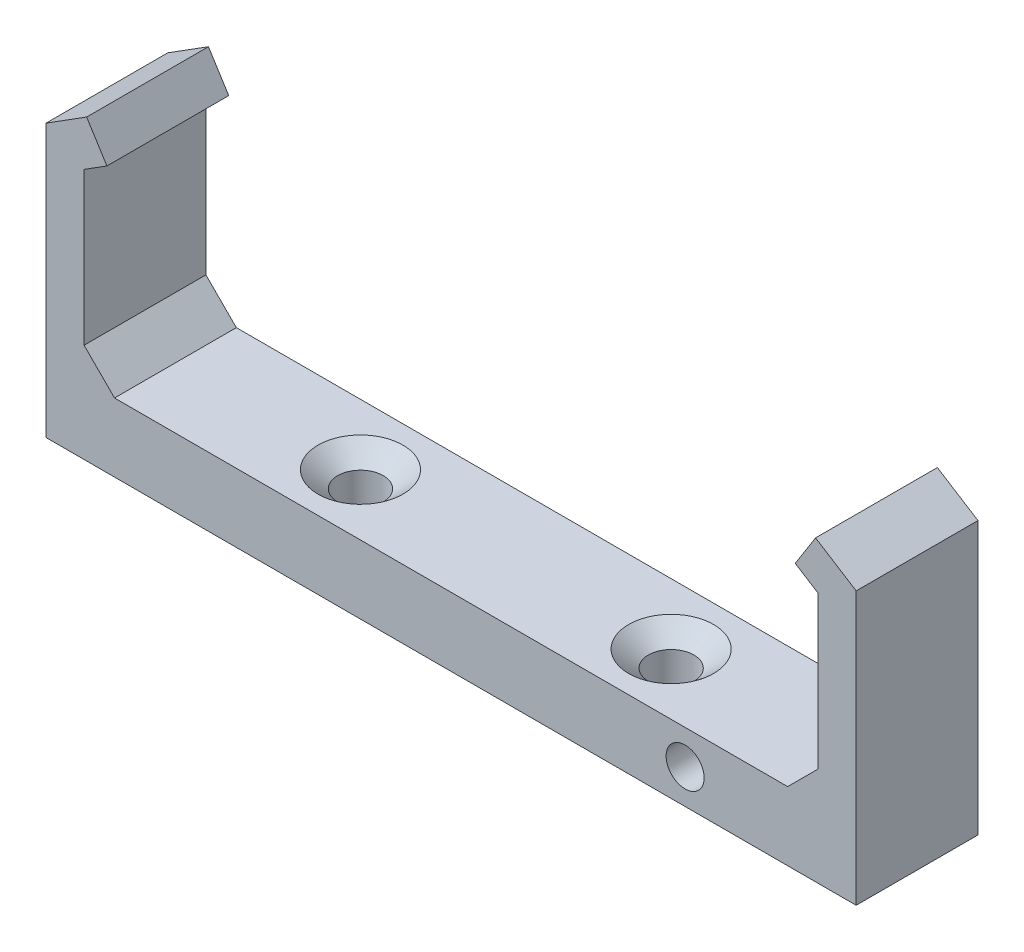
ISO-10303-21;
HEADER;
FILE_DESCRIPTION(('STEP AP214'),'2;1');
FILE_NAME('part.step','',(''),(''),'','','');
FILE_SCHEMA(('AUTOMOTIVE_DESIGN { 1 0 10303 214 1 1 1 1 }'));
ENDSEC;
DATA;
#1=APPLICATION_CONTEXT('core data for automotive mechanical design processes');
#2=APPLICATION_PROTOCOL_DEFINITION('international standard','automotive_design',2000,#1);
#3=PRODUCT_CONTEXT('',#1,'mechanical');
#4=PRODUCT('Part','Part','',(#3));
#5=PRODUCT_RELATED_PRODUCT_CATEGORY('part','',(#4));
#6=PRODUCT_DEFINITION_FORMATION('','',#4);
#7=PRODUCT_DEFINITION_CONTEXT('part definition',#1,'design');
#8=PRODUCT_DEFINITION('design','',#6,#7);
#9=PRODUCT_DEFINITION_SHAPE('','',#8);
#10=(LENGTH_UNIT() NAMED_UNIT(*) SI_UNIT(.MILLI.,.METRE.));
#11=(NAMED_UNIT(*) PLANE_ANGLE_UNIT() SI_UNIT($,.RADIAN.));
#12=(NAMED_UNIT(*) SI_UNIT($,.STERADIAN.) SOLID_ANGLE_UNIT());
#13=UNCERTAINTY_MEASURE_WITH_UNIT(LENGTH_MEASURE(1.E-05),#10,'distance_accuracy_value','');
#14=(GEOMETRIC_REPRESENTATION_CONTEXT(3) GLOBAL_UNCERTAINTY_ASSIGNED_CONTEXT((#13)) GLOBAL_UNIT_ASSIGNED_CONTEXT((#10,
#11,#12)) REPRESENTATION_CONTEXT('',''));
#15=CARTESIAN_POINT('',(0.,0.,0.));
#16=DIRECTION('',(0.,0.,1.));
#17=DIRECTION('',(1.,0.,0.));
#18=AXIS2_PLACEMENT_3D('',#15,#16,#17);
#19=CARTESIAN_POINT('',(0.,0.0704574444268354,-5.08));
#20=DIRECTION('',(0.,-1.,0.));
#21=DIRECTION('',(1.,0.,0.));
#22=AXIS2_PLACEMENT_3D('',#19,#20,#21);
#23=PLANE('',#22);
#24=CARTESIAN_POINT('',(-12.954,0.070457444426839,0.));
#25=DIRECTION('',(0.,1.,0.));
#26=DIRECTION('',(0.,0.,1.));
#27=AXIS2_PLACEMENT_3D('',#24,#25,#26);
#28=CIRCLE('',#27,3.5433);
#29=CARTESIAN_POINT('',(-12.954,0.070457444426839,3.5433));
#30=VERTEX_POINT('',#29);
#31=EDGE_CURVE('E171',#30,#30,#28,.T.);
#32=ORIENTED_EDGE('',*,*,#31,.F.);
#33=EDGE_LOOP('',(#32));
#34=FACE_BOUND('',#33,.T.);
#35=CARTESIAN_POINT('',(12.954,0.0704574444268355,0.));
#36=DIRECTION('',(0.,1.,0.));
#37=DIRECTION('',(0.,0.,1.));
#38=AXIS2_PLACEMENT_3D('',#35,#36,#37);
#39=CIRCLE('',#38,3.5433);
#40=CARTESIAN_POINT('',(12.954,0.0704574444268355,3.5433));
#41=VERTEX_POINT('',#40);
#42=EDGE_CURVE('E177',#41,#41,#39,.T.);
#43=ORIENTED_EDGE('',*,*,#42,.F.);
#44=EDGE_LOOP('',(#43));
#45=FACE_BOUND('',#44,.T.);
#46=DIRECTION('',(1.,0.,0.));
#47=VECTOR('',#46,1.);
#48=CARTESIAN_POINT('',(0.,0.0704574444268354,-5.08));
#49=LINE('',#48,#47);
#50=CARTESIAN_POINT('',(-28.3845,0.0704574444268389,-5.08));
#51=VERTEX_POINT('',#50);
#52=CARTESIAN_POINT('',(27.7495,0.0704574444268319,-5.08));
#53=VERTEX_POINT('',#52);
#54=EDGE_CURVE('E230',#51,#53,#49,.T.);
#55=ORIENTED_EDGE('',*,*,#54,.F.);
#56=DIRECTION('',(0.,0.,1.));
#57=VECTOR('',#56,1.);
#58=CARTESIAN_POINT('',(-28.3845,0.0704574444268389,-5.08));
#59=LINE('',#58,#57);
#60=CARTESIAN_POINT('',(-28.3845,0.0704574444268389,5.08));
#61=VERTEX_POINT('',#60);
#62=EDGE_CURVE('E261',#51,#61,#59,.T.);
#63=ORIENTED_EDGE('',*,*,#62,.T.);
#64=DIRECTION('',(1.,0.,0.));
#65=VECTOR('',#64,1.);
#66=CARTESIAN_POINT('',(0.,0.0704574444268354,5.08));
#67=LINE('',#66,#65);
#68=CARTESIAN_POINT('',(27.7495,0.0704574444268319,5.08));
#69=VERTEX_POINT('',#68);
#70=EDGE_CURVE('E209',#61,#69,#67,.T.);
#71=ORIENTED_EDGE('',*,*,#70,.T.);
#72=DIRECTION('',(0.,0.,-1.));
#73=VECTOR('',#72,1.);
#74=CARTESIAN_POINT('',(27.7495,0.0704574444268319,-5.08));
#75=LINE('',#74,#73);
#76=EDGE_CURVE('E253',#69,#53,#75,.T.);
#77=ORIENTED_EDGE('',*,*,#76,.T.);
#78=EDGE_LOOP('',(#55,#63,#71,#77));
#79=FACE_BOUND('',#78,.T.);
#80=ADVANCED_FACE('F35',(#34,#45,#79),#23,.F.);
#81=CARTESIAN_POINT('',(-15.6836698362084,24.9073206274878,-5.08));
#82=DIRECTION('',(-0.53284447853788,0.846213189268339,0.));
#83=DIRECTION('',(-0.84621318926834,-0.53284447853788,0.));
#84=AXIS2_PLACEMENT_3D('',#81,#82,#83);
#85=PLANE('',#84);
#86=DIRECTION('',(0.,0.,1.));
#87=VECTOR('',#86,1.);
#88=CARTESIAN_POINT('',(-29.0195,16.51,-5.08));
#89=LINE('',#88,#87);
#90=CARTESIAN_POINT('',(-29.0195,16.51,-5.08));
#91=VERTEX_POINT('',#90);
#92=CARTESIAN_POINT('',(-29.0195,16.51,5.08));
#93=VERTEX_POINT('',#92);
#94=EDGE_CURVE('E234',#91,#93,#89,.T.);
#95=ORIENTED_EDGE('',*,*,#94,.T.);
#96=DIRECTION('',(-0.84621318926834,-0.53284447853788,0.));
#97=VECTOR('',#96,1.);
#98=CARTESIAN_POINT('',(-15.6836698362084,24.9073206274878,5.08));
#99=LINE('',#98,#97);
#100=CARTESIAN_POINT('',(-30.9245,15.3104574444268,5.08));
#101=VERTEX_POINT('',#100);
#102=EDGE_CURVE('E183',#93,#101,#99,.T.);
#103=ORIENTED_EDGE('',*,*,#102,.T.);
#104=DIRECTION('',(0.,0.,1.));
#105=VECTOR('',#104,1.);
#106=CARTESIAN_POINT('',(-30.9245,15.3104574444268,-5.08));
#107=LINE('',#106,#105);
#108=CARTESIAN_POINT('',(-30.9245,15.3104574444268,-5.08));
#109=VERTEX_POINT('',#108);
#110=EDGE_CURVE('E235',#109,#101,#107,.T.);
#111=ORIENTED_EDGE('',*,*,#110,.F.);
#112=DIRECTION('',(-0.84621318926834,-0.53284447853788,0.));
#113=VECTOR('',#112,1.);
#114=CARTESIAN_POINT('',(-15.6836698362084,24.9073206274878,-5.08));
#115=LINE('',#114,#113);
#116=EDGE_CURVE('E213',#91,#109,#115,.T.);
#117=ORIENTED_EDGE('',*,*,#116,.F.);
#118=EDGE_LOOP('',(#95,#103,#111,#117));
#119=FACE_BOUND('',#118,.T.);
#120=ADVANCED_FACE('F306',(#119),#85,.F.);
#121=CARTESIAN_POINT('',(-30.9245,0.,-5.08));
#122=DIRECTION('',(1.,0.,0.));
#123=DIRECTION('',(0.,0.,-1.));
#124=AXIS2_PLACEMENT_3D('',#121,#122,#123);
#125=PLANE('',#124);
#126=DIRECTION('',(0.,1.,0.));
#127=VECTOR('',#126,1.);
#128=CARTESIAN_POINT('',(-30.9245,0.,5.08));
#129=LINE('',#128,#127);
#130=CARTESIAN_POINT('',(-30.9245,2.61045744442683,5.08));
#131=VERTEX_POINT('',#130);
#132=EDGE_CURVE('E211',#131,#101,#129,.T.);
#133=ORIENTED_EDGE('',*,*,#132,.F.);
#134=DIRECTION('',(0.,0.,-1.));
#135=VECTOR('',#134,1.);
#136=CARTESIAN_POINT('',(-30.9245,2.61045744442683,-5.08));
#137=LINE('',#136,#135);
#138=CARTESIAN_POINT('',(-30.9245,2.61045744442683,-5.08));
#139=VERTEX_POINT('',#138);
#140=EDGE_CURVE('E50',#131,#139,#137,.T.);
#141=ORIENTED_EDGE('',*,*,#140,.T.);
#142=DIRECTION('',(0.,1.,0.));
#143=VECTOR('',#142,1.);
#144=CARTESIAN_POINT('',(-30.9245,0.,-5.08));
#145=LINE('',#144,#143);
#146=EDGE_CURVE('E232',#139,#109,#145,.T.);
#147=ORIENTED_EDGE('',*,*,#146,.T.);
#148=ORIENTED_EDGE('',*,*,#110,.T.);
#149=EDGE_LOOP('',(#133,#141,#147,#148));
#150=FACE_BOUND('',#149,.T.);
#151=ADVANCED_FACE('F322',(#150),#125,.T.);
#152=CARTESIAN_POINT('',(30.2895,0.,-5.08));
#153=DIRECTION('',(-1.,0.,0.));
#154=DIRECTION('',(0.,0.,1.));
#155=AXIS2_PLACEMENT_3D('',#152,#153,#154);
#156=PLANE('',#155);
#157=DIRECTION('',(0.,-1.,0.));
#158=VECTOR('',#157,1.);
#159=CARTESIAN_POINT('',(30.2895,0.,-5.08));
#160=LINE('',#159,#158);
#161=CARTESIAN_POINT('',(30.2895,15.3104574444268,-5.08));
#162=VERTEX_POINT('',#161);
#163=CARTESIAN_POINT('',(30.2895,2.61045744442686,-5.08));
#164=VERTEX_POINT('',#163);
#165=EDGE_CURVE('E227',#162,#164,#160,.T.);
#166=ORIENTED_EDGE('',*,*,#165,.T.);
#167=DIRECTION('',(0.,0.,1.));
#168=VECTOR('',#167,1.);
#169=CARTESIAN_POINT('',(30.2895,2.61045744442686,-5.08));
#170=LINE('',#169,#168);
#171=CARTESIAN_POINT('',(30.2895,2.61045744442686,5.08));
#172=VERTEX_POINT('',#171);
#173=EDGE_CURVE('E238',#164,#172,#170,.T.);
#174=ORIENTED_EDGE('',*,*,#173,.T.);
#175=DIRECTION('',(0.,-1.,0.));
#176=VECTOR('',#175,1.);
#177=CARTESIAN_POINT('',(30.2895,0.,5.08));
#178=LINE('',#177,#176);
#179=CARTESIAN_POINT('',(30.2895,15.3104574444268,5.08));
#180=VERTEX_POINT('',#179);
#181=EDGE_CURVE('E206',#180,#172,#178,.T.);
#182=ORIENTED_EDGE('',*,*,#181,.F.);
#183=DIRECTION('',(0.,0.,1.));
#184=VECTOR('',#183,1.);
#185=CARTESIAN_POINT('',(30.2895,15.3104574444268,-5.08));
#186=LINE('',#185,#184);
#187=EDGE_CURVE('E239',#162,#180,#186,.T.);
#188=ORIENTED_EDGE('',*,*,#187,.F.);
#189=EDGE_LOOP('',(#166,#174,#182,#188));
#190=FACE_BOUND('',#189,.T.);
#191=ADVANCED_FACE('F280',(#190),#156,.T.);
#192=CARTESIAN_POINT('',(15.5033785798826,24.6209991112524,-5.08));
#193=DIRECTION('',(-0.53284447853788,-0.846213189268339,0.));
#194=DIRECTION('',(0.84621318926834,-0.53284447853788,0.));
#195=AXIS2_PLACEMENT_3D('',#192,#193,#194);
#196=PLANE('',#195);
#197=ORIENTED_EDGE('',*,*,#187,.T.);
#198=DIRECTION('',(0.84621318926834,-0.53284447853788,0.));
#199=VECTOR('',#198,1.);
#200=CARTESIAN_POINT('',(15.5033785798826,24.6209991112524,5.08));
#201=LINE('',#200,#199);
#202=CARTESIAN_POINT('',(28.3845,16.51,5.08));
#203=VERTEX_POINT('',#202);
#204=EDGE_CURVE('E203',#203,#180,#201,.T.);
#205=ORIENTED_EDGE('',*,*,#204,.F.);
#206=DIRECTION('',(0.,0.,1.));
#207=VECTOR('',#206,1.);
#208=CARTESIAN_POINT('',(28.3845,16.51,-5.08));
#209=LINE('',#208,#207);
#210=CARTESIAN_POINT('',(28.3845,16.51,-5.08));
#211=VERTEX_POINT('',#210);
#212=EDGE_CURVE('E241',#211,#203,#209,.T.);
#213=ORIENTED_EDGE('',*,*,#212,.F.);
#214=DIRECTION('',(0.84621318926834,-0.53284447853788,0.));
#215=VECTOR('',#214,1.);
#216=CARTESIAN_POINT('',(15.5033785798826,24.6209991112524,-5.08));
#217=LINE('',#216,#215);
#218=EDGE_CURVE('E224',#211,#162,#217,.T.);
#219=ORIENTED_EDGE('',*,*,#218,.T.);
#220=EDGE_LOOP('',(#197,#205,#213,#219));
#221=FACE_BOUND('',#220,.T.);
#222=ADVANCED_FACE('F283',(#221),#196,.T.);
#223=CARTESIAN_POINT('',(12.8811214201174,-8.11099911125242,-5.08));
#224=DIRECTION('',(0.846213189268339,-0.532844478537881,0.));
#225=DIRECTION('',(0.532844478537881,0.846213189268339,0.));
#226=AXIS2_PLACEMENT_3D('',#223,#224,#225);
#227=PLANE('',#226);
#228=ORIENTED_EDGE('',*,*,#212,.T.);
#229=DIRECTION('',(0.532844478537881,0.846213189268339,0.));
#230=VECTOR('',#229,1.);
#231=CARTESIAN_POINT('',(12.8811214201174,-8.11099911125242,5.08));
#232=LINE('',#231,#230);
#233=CARTESIAN_POINT('',(30.0762812193578,19.196726875927,5.08));
#234=VERTEX_POINT('',#233);
#235=EDGE_CURVE('E200',#203,#234,#232,.T.);
#236=ORIENTED_EDGE('',*,*,#235,.T.);
#237=DIRECTION('',(0.,0.,1.));
#238=VECTOR('',#237,1.);
#239=CARTESIAN_POINT('',(30.0762812193578,19.196726875927,-5.08));
#240=LINE('',#239,#238);
#241=CARTESIAN_POINT('',(30.0762812193578,19.196726875927,-5.08));
#242=VERTEX_POINT('',#241);
#243=EDGE_CURVE('E243',#242,#234,#240,.T.);
#244=ORIENTED_EDGE('',*,*,#243,.F.);
#245=DIRECTION('',(0.532844478537881,0.846213189268339,0.));
#246=VECTOR('',#245,1.);
#247=CARTESIAN_POINT('',(12.8811214201174,-8.11099911125242,-5.08));
#248=LINE('',#247,#246);
#249=EDGE_CURVE('E222',#211,#242,#248,.T.);
#250=ORIENTED_EDGE('',*,*,#249,.F.);
#251=EDGE_LOOP('',(#228,#236,#244,#250));
#252=FACE_BOUND('',#251,.T.);
#253=ADVANCED_FACE('F288',(#252),#227,.F.);
#254=CARTESIAN_POINT('',(17.1951597992404,27.3077259871794,-5.08));
#255=DIRECTION('',(-0.532844478537881,-0.846213189268339,0.));
#256=DIRECTION('',(0.846213189268339,-0.532844478537881,0.));
#257=AXIS2_PLACEMENT_3D('',#254,#255,#256);
#258=PLANE('',#257);
#259=ORIENTED_EDGE('',*,*,#243,.T.);
#260=DIRECTION('',(0.846213189268339,-0.532844478537881,0.));
#261=VECTOR('',#260,1.);
#262=CARTESIAN_POINT('',(17.1951597992404,27.3077259871794,5.08));
#263=LINE('',#262,#261);
#264=CARTESIAN_POINT('',(33.4645,17.0632294402458,5.08));
#265=VERTEX_POINT('',#264);
#266=EDGE_CURVE('E197',#234,#265,#263,.T.);
#267=ORIENTED_EDGE('',*,*,#266,.T.);
#268=DIRECTION('',(0.,0.,1.));
#269=VECTOR('',#268,1.);
#270=CARTESIAN_POINT('',(33.4645,17.0632294402458,-5.08));
#271=LINE('',#270,#269);
#272=CARTESIAN_POINT('',(33.4645,17.0632294402458,-5.08));
#273=VERTEX_POINT('',#272);
#274=EDGE_CURVE('E245',#273,#265,#271,.T.);
#275=ORIENTED_EDGE('',*,*,#274,.F.);
#276=DIRECTION('',(0.846213189268339,-0.532844478537881,0.));
#277=VECTOR('',#276,1.);
#278=CARTESIAN_POINT('',(17.1951597992404,27.3077259871794,-5.08));
#279=LINE('',#278,#277);
#280=EDGE_CURVE('E220',#242,#273,#279,.T.);
#281=ORIENTED_EDGE('',*,*,#280,.F.);
#282=EDGE_LOOP('',(#259,#267,#275,#281));
#283=FACE_BOUND('',#282,.T.);
#284=ADVANCED_FACE('F293',(#283),#258,.F.);
#285=CARTESIAN_POINT('',(33.4645,0.,-5.08));
#286=DIRECTION('',(1.,0.,0.));
#287=DIRECTION('',(0.,0.,-1.));
#288=AXIS2_PLACEMENT_3D('',#285,#286,#287);
#289=PLANE('',#288);
#290=ORIENTED_EDGE('',*,*,#274,.T.);
#291=DIRECTION('',(0.,1.,0.));
#292=VECTOR('',#291,1.);
#293=CARTESIAN_POINT('',(33.4645,0.,5.08));
#294=LINE('',#293,#292);
#295=CARTESIAN_POINT('',(33.4645,-5.64454255557316,5.08));
#296=VERTEX_POINT('',#295);
#297=EDGE_CURVE('E194',#296,#265,#294,.T.);
#298=ORIENTED_EDGE('',*,*,#297,.F.);
#299=DIRECTION('',(0.,0.,1.));
#300=VECTOR('',#299,1.);
#301=CARTESIAN_POINT('',(33.4645,-5.64454255557316,5.08));
#302=LINE('',#301,#300);
#303=CARTESIAN_POINT('',(33.4645,-5.64454255557316,-5.08));
#304=VERTEX_POINT('',#303);
#305=EDGE_CURVE('E155',#304,#296,#302,.T.);
#306=ORIENTED_EDGE('',*,*,#305,.F.);
#307=DIRECTION('',(0.,1.,0.));
#308=VECTOR('',#307,1.);
#309=CARTESIAN_POINT('',(33.4645,0.,-5.08));
#310=LINE('',#309,#308);
#311=EDGE_CURVE('E144',#304,#273,#310,.T.);
#312=ORIENTED_EDGE('',*,*,#311,.T.);
#313=EDGE_LOOP('',(#290,#298,#306,#312));
#314=FACE_BOUND('',#313,.T.);
#315=ADVANCED_FACE('F295',(#314),#289,.T.);
#316=CARTESIAN_POINT('',(-34.0995,0.,-5.08));
#317=DIRECTION('',(1.,0.,0.));
#318=DIRECTION('',(0.,0.,-1.));
#319=AXIS2_PLACEMENT_3D('',#316,#317,#318);
#320=PLANE('',#319);
#321=DIRECTION('',(0.,1.,0.));
#322=VECTOR('',#321,1.);
#323=CARTESIAN_POINT('',(-34.0995,0.,-5.08));
#324=LINE('',#323,#322);
#325=CARTESIAN_POINT('',(-34.0995,-5.64454255557317,-5.08));
#326=VERTEX_POINT('',#325);
#327=CARTESIAN_POINT('',(-34.0995,17.0632294402458,-5.08));
#328=VERTEX_POINT('',#327);
#329=EDGE_CURVE('E134',#326,#328,#324,.T.);
#330=ORIENTED_EDGE('',*,*,#329,.F.);
#331=DIRECTION('',(0.,0.,-1.));
#332=VECTOR('',#331,1.);
#333=CARTESIAN_POINT('',(-34.0995,-5.64454255557317,5.08));
#334=LINE('',#333,#332);
#335=CARTESIAN_POINT('',(-34.0995,-5.64454255557317,5.08));
#336=VERTEX_POINT('',#335);
#337=EDGE_CURVE('E139',#336,#326,#334,.T.);
#338=ORIENTED_EDGE('',*,*,#337,.F.);
#339=DIRECTION('',(0.,1.,0.));
#340=VECTOR('',#339,1.);
#341=CARTESIAN_POINT('',(-34.0995,0.,5.08));
#342=LINE('',#341,#340);
#343=CARTESIAN_POINT('',(-34.0995,17.0632294402458,5.08));
#344=VERTEX_POINT('',#343);
#345=EDGE_CURVE('E192',#336,#344,#342,.T.);
#346=ORIENTED_EDGE('',*,*,#345,.T.);
#347=DIRECTION('',(0.,0.,1.));
#348=VECTOR('',#347,1.);
#349=CARTESIAN_POINT('',(-34.0995,17.0632294402458,-5.08));
#350=LINE('',#349,#348);
#351=EDGE_CURVE('E140',#328,#344,#350,.T.);
#352=ORIENTED_EDGE('',*,*,#351,.F.);
#353=EDGE_LOOP('',(#330,#338,#346,#352));
#354=FACE_BOUND('',#353,.T.);
#355=ADVANCED_FACE('F136',(#354),#320,.F.);
#356=CARTESIAN_POINT('',(-17.3754510555662,27.5940475034148,-5.08));
#357=DIRECTION('',(-0.532844478537881,0.846213189268339,0.));
#358=DIRECTION('',(-0.846213189268339,-0.532844478537881,0.));
#359=AXIS2_PLACEMENT_3D('',#356,#357,#358);
#360=PLANE('',#359);
#361=ORIENTED_EDGE('',*,*,#351,.T.);
#362=DIRECTION('',(-0.846213189268339,-0.532844478537881,0.));
#363=VECTOR('',#362,1.);
#364=CARTESIAN_POINT('',(-17.3754510555662,27.5940475034148,5.08));
#365=LINE('',#364,#363);
#366=CARTESIAN_POINT('',(-30.7112812193578,19.196726875927,5.08));
#367=VERTEX_POINT('',#366);
#368=EDGE_CURVE('E189',#367,#344,#365,.T.);
#369=ORIENTED_EDGE('',*,*,#368,.F.);
#370=DIRECTION('',(0.,0.,1.));
#371=VECTOR('',#370,1.);
#372=CARTESIAN_POINT('',(-30.7112812193578,19.196726875927,-5.08));
#373=LINE('',#372,#371);
#374=CARTESIAN_POINT('',(-30.7112812193578,19.196726875927,-5.08));
#375=VERTEX_POINT('',#374);
#376=EDGE_CURVE('E248',#375,#367,#373,.T.);
#377=ORIENTED_EDGE('',*,*,#376,.F.);
#378=DIRECTION('',(-0.846213189268339,-0.532844478537881,0.));
#379=VECTOR('',#378,1.);
#380=CARTESIAN_POINT('',(-17.3754510555662,27.5940475034148,-5.08));
#381=LINE('',#380,#379);
#382=EDGE_CURVE('E145',#375,#328,#381,.T.);
#383=ORIENTED_EDGE('',*,*,#382,.T.);
#384=EDGE_LOOP('',(#361,#369,#377,#383));
#385=FACE_BOUND('',#384,.T.);
#386=ADVANCED_FACE('F299',(#385),#360,.T.);
#387=CARTESIAN_POINT('',(-13.3358301637916,-8.39732062748783,-5.08));
#388=DIRECTION('',(0.846213189268339,0.532844478537881,0.));
#389=DIRECTION('',(-0.532844478537881,0.846213189268339,0.));
#390=AXIS2_PLACEMENT_3D('',#387,#388,#389);
#391=PLANE('',#390);
#392=ORIENTED_EDGE('',*,*,#376,.T.);
#393=DIRECTION('',(-0.532844478537881,0.846213189268339,0.));
#394=VECTOR('',#393,1.);
#395=CARTESIAN_POINT('',(-13.3358301637916,-8.39732062748783,5.08));
#396=LINE('',#395,#394);
#397=EDGE_CURVE('E186',#93,#367,#396,.T.);
#398=ORIENTED_EDGE('',*,*,#397,.F.);
#399=ORIENTED_EDGE('',*,*,#94,.F.);
#400=DIRECTION('',(-0.532844478537881,0.846213189268339,0.));
#401=VECTOR('',#400,1.);
#402=CARTESIAN_POINT('',(-13.3358301637916,-8.39732062748783,-5.08));
#403=LINE('',#402,#401);
#404=EDGE_CURVE('E215',#91,#375,#403,.T.);
#405=ORIENTED_EDGE('',*,*,#404,.T.);
#406=EDGE_LOOP('',(#392,#398,#399,#405));
#407=FACE_BOUND('',#406,.T.);
#408=ADVANCED_FACE('F302',(#407),#391,.T.);
#409=CARTESIAN_POINT('',(0.,0.,-5.08));
#410=DIRECTION('',(0.,0.,1.));
#411=DIRECTION('',(1.,0.,0.));
#412=AXIS2_PLACEMENT_3D('',#409,#410,#411);
#413=PLANE('',#412);
#414=CARTESIAN_POINT('',(19.2005275440801,-2.78704255557316,-5.08));
#415=DIRECTION('',(0.,0.,1.));
#416=DIRECTION('',(1.,0.,0.));
#417=AXIS2_PLACEMENT_3D('',#414,#415,#416);
#418=CIRCLE('',#417,1.5875);
#419=CARTESIAN_POINT('',(20.7880275440801,-2.78704255557316,-5.08));
#420=VERTEX_POINT('',#419);
#421=EDGE_CURVE('E376',#420,#420,#418,.T.);
#422=ORIENTED_EDGE('',*,*,#421,.T.);
#423=EDGE_LOOP('',(#422));
#424=FACE_BOUND('',#423,.T.);
#425=ORIENTED_EDGE('',*,*,#116,.T.);
#426=ORIENTED_EDGE('',*,*,#146,.F.);
#427=DIRECTION('',(0.707106781186551,-0.707106781186544,0.));
#428=VECTOR('',#427,1.);
#429=CARTESIAN_POINT('',(-14.1570212777864,-14.1570212777866,-5.08));
#430=LINE('',#429,#428);
#431=EDGE_CURVE('E11',#139,#51,#430,.T.);
#432=ORIENTED_EDGE('',*,*,#431,.T.);
#433=ORIENTED_EDGE('',*,*,#54,.T.);
#434=DIRECTION('',(0.707106781186544,0.707106781186551,0.));
#435=VECTOR('',#434,1.);
#436=CARTESIAN_POINT('',(13.8395212777867,-13.8395212777866,-5.08));
#437=LINE('',#436,#435);
#438=EDGE_CURVE('E259',#53,#164,#437,.T.);
#439=ORIENTED_EDGE('',*,*,#438,.T.);
#440=ORIENTED_EDGE('',*,*,#165,.F.);
#441=ORIENTED_EDGE('',*,*,#218,.F.);
#442=ORIENTED_EDGE('',*,*,#249,.T.);
#443=ORIENTED_EDGE('',*,*,#280,.T.);
#444=ORIENTED_EDGE('',*,*,#311,.F.);
#445=DIRECTION('',(1.,0.,0.));
#446=VECTOR('',#445,1.);
#447=CARTESIAN_POINT('',(-34.0995,-5.64454255557317,-5.08));
#448=LINE('',#447,#446);
#449=EDGE_CURVE('E148',#326,#304,#448,.T.);
#450=ORIENTED_EDGE('',*,*,#449,.F.);
#451=ORIENTED_EDGE('',*,*,#329,.T.);
#452=ORIENTED_EDGE('',*,*,#382,.F.);
#453=ORIENTED_EDGE('',*,*,#404,.F.);
#454=EDGE_LOOP('',(#425,#426,#432,#433,#439,#440,#441,#442,#443,#444,#450,#451,#452,#453));
#455=FACE_BOUND('',#454,.T.);
#456=ADVANCED_FACE('F150',(#424,#455),#413,.F.);
#457=CARTESIAN_POINT('',(0.,0.,5.08));
#458=DIRECTION('',(0.,0.,1.));
#459=DIRECTION('',(1.,0.,0.));
#460=AXIS2_PLACEMENT_3D('',#457,#458,#459);
#461=PLANE('',#460);
#462=CARTESIAN_POINT('',(19.2005275440801,-2.78704255557316,5.08));
#463=DIRECTION('',(0.,0.,1.));
#464=DIRECTION('',(1.,0.,0.));
#465=AXIS2_PLACEMENT_3D('',#462,#463,#464);
#466=CIRCLE('',#465,1.5875);
#467=CARTESIAN_POINT('',(20.7880275440801,-2.78704255557316,5.08));
#468=VERTEX_POINT('',#467);
#469=EDGE_CURVE('E379',#468,#468,#466,.T.);
#470=ORIENTED_EDGE('',*,*,#469,.F.);
#471=EDGE_LOOP('',(#470));
#472=FACE_BOUND('',#471,.T.);
#473=ORIENTED_EDGE('',*,*,#102,.F.);
#474=ORIENTED_EDGE('',*,*,#397,.T.);
#475=ORIENTED_EDGE('',*,*,#368,.T.);
#476=ORIENTED_EDGE('',*,*,#345,.F.);
#477=DIRECTION('',(-1.,0.,0.));
#478=VECTOR('',#477,1.);
#479=CARTESIAN_POINT('',(-34.0995,-5.64454255557317,5.08));
#480=LINE('',#479,#478);
#481=EDGE_CURVE('E161',#296,#336,#480,.T.);
#482=ORIENTED_EDGE('',*,*,#481,.F.);
#483=ORIENTED_EDGE('',*,*,#297,.T.);
#484=ORIENTED_EDGE('',*,*,#266,.F.);
#485=ORIENTED_EDGE('',*,*,#235,.F.);
#486=ORIENTED_EDGE('',*,*,#204,.T.);
#487=ORIENTED_EDGE('',*,*,#181,.T.);
#488=DIRECTION('',(-0.707106781186544,-0.707106781186551,0.));
#489=VECTOR('',#488,1.);
#490=CARTESIAN_POINT('',(30.2895,2.61045744442686,5.08));
#491=LINE('',#490,#489);
#492=EDGE_CURVE('E256',#172,#69,#491,.T.);
#493=ORIENTED_EDGE('',*,*,#492,.T.);
#494=ORIENTED_EDGE('',*,*,#70,.F.);
#495=DIRECTION('',(-0.707106781186551,0.707106781186544,0.));
#496=VECTOR('',#495,1.);
#497=CARTESIAN_POINT('',(-28.3845,0.0704574444268389,5.08));
#498=LINE('',#497,#496);
#499=EDGE_CURVE('E43',#61,#131,#498,.T.);
#500=ORIENTED_EDGE('',*,*,#499,.T.);
#501=ORIENTED_EDGE('',*,*,#132,.T.);
#502=EDGE_LOOP('',(#473,#474,#475,#476,#482,#483,#484,#485,#486,#487,#493,#494,#500,#501));
#503=FACE_BOUND('',#502,.T.);
#504=ADVANCED_FACE('F270',(#472,#503),#461,.T.);
#505=CARTESIAN_POINT('',(30.2895,2.61045744442686,-5.08));
#506=DIRECTION('',(0.707106781186551,-0.707106781186544,0.));
#507=DIRECTION('',(0.,0.,1.));
#508=AXIS2_PLACEMENT_3D('',#505,#506,#507);
#509=PLANE('',#508);
#510=ORIENTED_EDGE('',*,*,#438,.F.);
#511=ORIENTED_EDGE('',*,*,#76,.F.);
#512=ORIENTED_EDGE('',*,*,#492,.F.);
#513=ORIENTED_EDGE('',*,*,#173,.F.);
#514=EDGE_LOOP('',(#510,#511,#512,#513));
#515=FACE_BOUND('',#514,.T.);
#516=ADVANCED_FACE('F276',(#515),#509,.F.);
#517=CARTESIAN_POINT('',(-28.3845,0.0704574444268389,-5.08));
#518=DIRECTION('',(-0.707106781186544,-0.707106781186551,0.));
#519=DIRECTION('',(0.,0.,1.));
#520=AXIS2_PLACEMENT_3D('',#517,#518,#519);
#521=PLANE('',#520);
#522=ORIENTED_EDGE('',*,*,#431,.F.);
#523=ORIENTED_EDGE('',*,*,#140,.F.);
#524=ORIENTED_EDGE('',*,*,#499,.F.);
#525=ORIENTED_EDGE('',*,*,#62,.F.);
#526=EDGE_LOOP('',(#522,#523,#524,#525));
#527=FACE_BOUND('',#526,.T.);
#528=ADVANCED_FACE('F37',(#527),#521,.F.);
#529=CARTESIAN_POINT('',(12.954,0.0704574444268338,0.));
#530=DIRECTION('',(0.,1.,0.));
#531=DIRECTION('',(0.,0.,1.));
#532=AXIS2_PLACEMENT_3D('',#529,#530,#531);
#533=CYLINDRICAL_SURFACE('',#532,1.89864999999999);
#534=CARTESIAN_POINT('',(12.954,-1.30956776398887,0.));
#535=DIRECTION('',(0.,1.,0.));
#536=DIRECTION('',(0.,0.,1.));
#537=AXIS2_PLACEMENT_3D('',#534,#535,#536);
#538=CIRCLE('',#537,1.89864999999999);
#539=CARTESIAN_POINT('',(12.954,-1.30956776398887,1.89864999999999));
#540=VERTEX_POINT('',#539);
#541=EDGE_CURVE('E180',#540,#540,#538,.T.);
#542=ORIENTED_EDGE('',*,*,#541,.T.);
#543=EDGE_LOOP('',(#542));
#544=FACE_BOUND('',#543,.T.);
#545=CARTESIAN_POINT('',(12.954,-5.64454255557316,0.));
#546=DIRECTION('',(0.,-1.,0.));
#547=DIRECTION('',(1.,0.,0.));
#548=AXIS2_PLACEMENT_3D('',#545,#546,#547);
#549=CIRCLE('',#548,1.89864999999999);
#550=CARTESIAN_POINT('',(14.85265,-5.64454255557316,0.));
#551=VERTEX_POINT('',#550);
#552=EDGE_CURVE('E165',#551,#551,#549,.T.);
#553=ORIENTED_EDGE('',*,*,#552,.T.);
#554=EDGE_LOOP('',(#553));
#555=FACE_BOUND('',#554,.T.);
#556=ADVANCED_FACE('F308',(#544,#555),#533,.F.);
#557=CARTESIAN_POINT('',(12.954,0.0704574444268355,0.));
#558=DIRECTION('',(0.,1.,0.));
#559=DIRECTION('',(0.,0.,1.));
#560=AXIS2_PLACEMENT_3D('',#557,#558,#559);
#561=CONICAL_SURFACE('',#560,3.5433,0.872664625997169);
#562=ORIENTED_EDGE('',*,*,#541,.F.);
#563=EDGE_LOOP('',(#562));
#564=FACE_BOUND('',#563,.T.);
#565=ORIENTED_EDGE('',*,*,#42,.T.);
#566=EDGE_LOOP('',(#565));
#567=FACE_BOUND('',#566,.T.);
#568=ADVANCED_FACE('F313',(#564,#567),#561,.F.);
#569=CARTESIAN_POINT('',(-12.954,0.0704574444268372,0.));
#570=DIRECTION('',(0.,1.,0.));
#571=DIRECTION('',(0.,0.,1.));
#572=AXIS2_PLACEMENT_3D('',#569,#570,#571);
#573=CYLINDRICAL_SURFACE('',#572,1.89864999999999);
#574=CARTESIAN_POINT('',(-12.954,-1.30956776398887,0.));
#575=DIRECTION('',(0.,1.,0.));
#576=DIRECTION('',(0.,0.,1.));
#577=AXIS2_PLACEMENT_3D('',#574,#575,#576);
#578=CIRCLE('',#577,1.89864999999999);
#579=CARTESIAN_POINT('',(-12.954,-1.30956776398887,1.89864999999999));
#580=VERTEX_POINT('',#579);
#581=EDGE_CURVE('E174',#580,#580,#578,.T.);
#582=ORIENTED_EDGE('',*,*,#581,.T.);
#583=EDGE_LOOP('',(#582));
#584=FACE_BOUND('',#583,.T.);
#585=CARTESIAN_POINT('',(-12.954,-5.64454255557317,0.));
#586=DIRECTION('',(0.,-1.,0.));
#587=DIRECTION('',(1.,0.,0.));
#588=AXIS2_PLACEMENT_3D('',#585,#586,#587);
#589=CIRCLE('',#588,1.89864999999999);
#590=CARTESIAN_POINT('',(-11.05535,-5.64454255557317,0.));
#591=VERTEX_POINT('',#590);
#592=EDGE_CURVE('E162',#591,#591,#589,.T.);
#593=ORIENTED_EDGE('',*,*,#592,.T.);
#594=EDGE_LOOP('',(#593));
#595=FACE_BOUND('',#594,.T.);
#596=ADVANCED_FACE('F357',(#584,#595),#573,.F.);
#597=CARTESIAN_POINT('',(-12.954,0.070457444426839,0.));
#598=DIRECTION('',(0.,1.,0.));
#599=DIRECTION('',(0.,0.,1.));
#600=AXIS2_PLACEMENT_3D('',#597,#598,#599);
#601=CONICAL_SURFACE('',#600,3.5433,0.872664625997169);
#602=ORIENTED_EDGE('',*,*,#581,.F.);
#603=EDGE_LOOP('',(#602));
#604=FACE_BOUND('',#603,.T.);
#605=ORIENTED_EDGE('',*,*,#31,.T.);
#606=EDGE_LOOP('',(#605));
#607=FACE_BOUND('',#606,.T.);
#608=ADVANCED_FACE('F361',(#604,#607),#601,.F.);
#609=CARTESIAN_POINT('',(0.,-5.64454255557316,0.));
#610=DIRECTION('',(0.,-1.,0.));
#611=DIRECTION('',(1.,0.,0.));
#612=AXIS2_PLACEMENT_3D('',#609,#610,#611);
#613=PLANE('',#612);
#614=ORIENTED_EDGE('',*,*,#592,.F.);
#615=EDGE_LOOP('',(#614));
#616=FACE_BOUND('',#615,.T.);
#617=ORIENTED_EDGE('',*,*,#337,.T.);
#618=ORIENTED_EDGE('',*,*,#449,.T.);
#619=ORIENTED_EDGE('',*,*,#305,.T.);
#620=ORIENTED_EDGE('',*,*,#481,.T.);
#621=EDGE_LOOP('',(#617,#618,#619,#620));
#622=FACE_BOUND('',#621,.T.);
#623=ORIENTED_EDGE('',*,*,#552,.F.);
#624=EDGE_LOOP('',(#623));
#625=FACE_BOUND('',#624,.T.);
#626=ADVANCED_FACE('F158',(#616,#622,#625),#613,.T.);
#627=CARTESIAN_POINT('',(19.2005275440801,-2.78704255557316,-5.08));
#628=DIRECTION('',(0.,0.,1.));
#629=DIRECTION('',(1.,0.,0.));
#630=AXIS2_PLACEMENT_3D('',#627,#628,#629);
#631=CYLINDRICAL_SURFACE('',#630,1.5875);
#632=ORIENTED_EDGE('',*,*,#421,.F.);
#633=EDGE_LOOP('',(#632));
#634=FACE_BOUND('',#633,.T.);
#635=ORIENTED_EDGE('',*,*,#469,.T.);
#636=EDGE_LOOP('',(#635));
#637=FACE_BOUND('',#636,.T.);
#638=ADVANCED_FACE('F368',(#634,#637),#631,.F.);
#639=CLOSED_SHELL('',(#80,#120,#151,#191,#222,#253,#284,#315,#355,#386,#408,#456,#504,#516,#528,
#556,#568,#596,#608,#626,#638));
#640=MANIFOLD_SOLID_BREP('B2',#639);
#641=ADVANCED_BREP_SHAPE_REPRESENTATION('',(#18,#640),#14);
#642=SHAPE_DEFINITION_REPRESENTATION(#9,#641);
ENDSEC;
END-ISO-10303-21;
